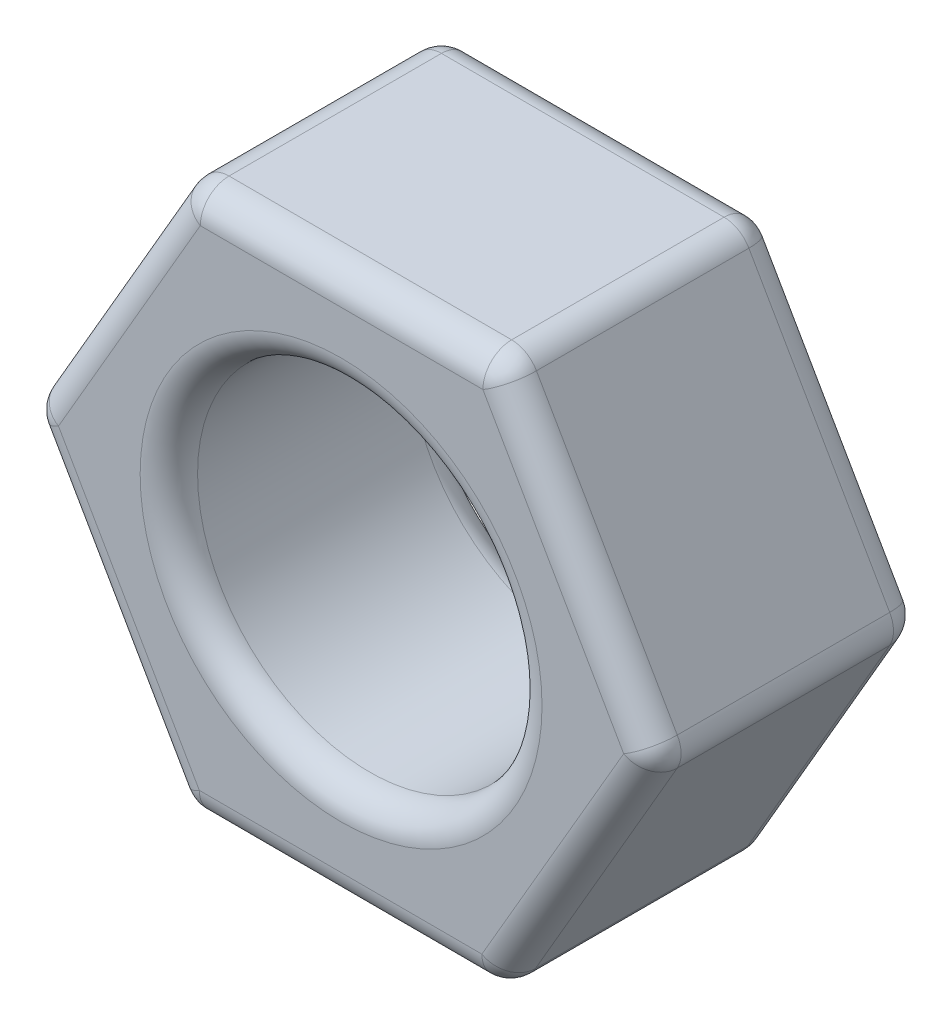
ISO-10303-21;
HEADER;
FILE_DESCRIPTION(('STEP AP214'),'2;1');
FILE_NAME('part.step','',(''),(''),'','','');
FILE_SCHEMA(('AUTOMOTIVE_DESIGN { 1 0 10303 214 1 1 1 1 }'));
ENDSEC;
DATA;
#1=APPLICATION_CONTEXT('core data for automotive mechanical design processes');
#2=APPLICATION_PROTOCOL_DEFINITION('international standard','automotive_design',2000,#1);
#3=PRODUCT_CONTEXT('',#1,'mechanical');
#4=PRODUCT('Part','Part','',(#3));
#5=PRODUCT_RELATED_PRODUCT_CATEGORY('part','',(#4));
#6=PRODUCT_DEFINITION_FORMATION('','',#4);
#7=PRODUCT_DEFINITION_CONTEXT('part definition',#1,'design');
#8=PRODUCT_DEFINITION('design','',#6,#7);
#9=PRODUCT_DEFINITION_SHAPE('','',#8);
#10=(LENGTH_UNIT() NAMED_UNIT(*) SI_UNIT(.MILLI.,.METRE.));
#11=(NAMED_UNIT(*) PLANE_ANGLE_UNIT() SI_UNIT($,.RADIAN.));
#12=(NAMED_UNIT(*) SI_UNIT($,.STERADIAN.) SOLID_ANGLE_UNIT());
#13=UNCERTAINTY_MEASURE_WITH_UNIT(LENGTH_MEASURE(1.E-05),#10,'distance_accuracy_value','');
#14=(GEOMETRIC_REPRESENTATION_CONTEXT(3) GLOBAL_UNCERTAINTY_ASSIGNED_CONTEXT((#13)) GLOBAL_UNIT_ASSIGNED_CONTEXT((#10,
#11,#12)) REPRESENTATION_CONTEXT('',''));
#15=CARTESIAN_POINT('',(0.,0.,0.));
#16=DIRECTION('',(0.,0.,1.));
#17=DIRECTION('',(1.,0.,0.));
#18=AXIS2_PLACEMENT_3D('',#15,#16,#17);
#19=CARTESIAN_POINT('',(0.,0.,4.7));
#20=DIRECTION('',(0.,0.,1.));
#21=DIRECTION('',(1.,0.,0.));
#22=AXIS2_PLACEMENT_3D('',#19,#20,#21);
#23=PLANE('',#22);
#24=CARTESIAN_POINT('',(0.,0.,4.7));
#25=DIRECTION('',(0.,0.,1.));
#26=DIRECTION('',(1.,0.,0.));
#27=AXIS2_PLACEMENT_3D('',#24,#25,#26);
#28=CIRCLE('',#27,3.5);
#29=CARTESIAN_POINT('',(3.5,0.,4.7));
#30=VERTEX_POINT('',#29);
#31=EDGE_CURVE('E305',#30,#30,#28,.F.);
#32=ORIENTED_EDGE('',*,*,#31,.T.);
#33=EDGE_LOOP('',(#32));
#34=FACE_BOUND('',#33,.T.);
#35=DIRECTION('',(-0.498244647432944,0.867036487873735,0.));
#36=VECTOR('',#35,1.);
#37=CARTESIAN_POINT('',(2.32612491040935,4.50843688880732,4.7));
#38=LINE('',#37,#36);
#39=CARTESIAN_POINT('',(4.92263963063168,-0.00997191966265563,4.7));
#40=VERTEX_POINT('',#39);
#41=CARTESIAN_POINT('',(2.4699557510682,4.25814501397176,4.7));
#42=VERTEX_POINT('',#41);
#43=EDGE_CURVE('E295',#40,#42,#38,.T.);
#44=ORIENTED_EDGE('',*,*,#43,.T.);
#45=DIRECTION('',(-0.999997948223165,0.00202572196031843,0.));
#46=VECTOR('',#45,1.);
#47=CARTESIAN_POINT('',(-2.74135842186134,4.26870170919396,4.7));
#48=LINE('',#47,#46);
#49=CARTESIAN_POINT('',(-2.45268387956348,4.26811693363441,4.7));
#50=VERTEX_POINT('',#49);
#51=EDGE_CURVE('E298',#42,#50,#48,.T.);
#52=ORIENTED_EDGE('',*,*,#51,.T.);
#53=DIRECTION('',(-0.501753300790222,-0.865010765913417,0.));
#54=VECTOR('',#53,1.);
#55=CARTESIAN_POINT('',(-5.06748333227069,-0.239735179613362,4.7));
#56=LINE('',#55,#54);
#57=CARTESIAN_POINT('',(-4.92263963063168,0.00997191966265725,4.7));
#58=VERTEX_POINT('',#57);
#59=EDGE_CURVE('E296',#50,#58,#56,.T.);
#60=ORIENTED_EDGE('',*,*,#59,.T.);
#61=DIRECTION('',(0.498244647432943,-0.867036487873736,0.));
#62=VECTOR('',#61,1.);
#63=CARTESIAN_POINT('',(-2.32612491040935,-4.50843688880732,4.7));
#64=LINE('',#63,#62);
#65=CARTESIAN_POINT('',(-2.4699557510682,-4.25814501397176,4.7));
#66=VERTEX_POINT('',#65);
#67=EDGE_CURVE('E396',#58,#66,#64,.T.);
#68=ORIENTED_EDGE('',*,*,#67,.T.);
#69=DIRECTION('',(0.999997948223165,-0.00202572196031827,0.));
#70=VECTOR('',#69,1.);
#71=CARTESIAN_POINT('',(2.74135842186135,-4.26870170919396,4.7));
#72=LINE('',#71,#70);
#73=CARTESIAN_POINT('',(2.45268387956349,-4.26811693363441,4.7));
#74=VERTEX_POINT('',#73);
#75=EDGE_CURVE('E300',#66,#74,#72,.T.);
#76=ORIENTED_EDGE('',*,*,#75,.T.);
#77=DIRECTION('',(0.501753300790222,0.865010765913418,0.));
#78=VECTOR('',#77,1.);
#79=CARTESIAN_POINT('',(5.06748333227069,0.239735179613363,4.7));
#80=LINE('',#79,#78);
#81=EDGE_CURVE('E291',#74,#40,#80,.T.);
#82=ORIENTED_EDGE('',*,*,#81,.T.);
#83=EDGE_LOOP('',(#44,#52,#60,#68,#76,#82));
#84=FACE_BOUND('',#83,.T.);
#85=ADVANCED_FACE('F35',(#34,#84),#23,.T.);
#86=CARTESIAN_POINT('',(0.,0.,0.));
#87=DIRECTION('',(0.,0.,1.));
#88=DIRECTION('',(1.,0.,0.));
#89=AXIS2_PLACEMENT_3D('',#86,#87,#88);
#90=PLANE('',#89);
#91=CARTESIAN_POINT('',(0.,0.,0.));
#92=DIRECTION('',(0.,0.,1.));
#93=DIRECTION('',(1.,0.,0.));
#94=AXIS2_PLACEMENT_3D('',#91,#92,#93);
#95=CIRCLE('',#94,3.5);
#96=CARTESIAN_POINT('',(3.5,0.,0.));
#97=VERTEX_POINT('',#96);
#98=EDGE_CURVE('E387',#97,#97,#95,.T.);
#99=ORIENTED_EDGE('',*,*,#98,.T.);
#100=EDGE_LOOP('',(#99));
#101=FACE_BOUND('',#100,.T.);
#102=DIRECTION('',(-0.999997948223165,0.00202572196031843,0.));
#103=VECTOR('',#102,1.);
#104=CARTESIAN_POINT('',(0.00863593575235954,4.26313097380308,0.));
#105=LINE('',#104,#103);
#106=CARTESIAN_POINT('',(-2.45268387956348,4.26811693363441,0.));
#107=VERTEX_POINT('',#106);
#108=CARTESIAN_POINT('',(2.4699557510682,4.25814501397175,0.));
#109=VERTEX_POINT('',#108);
#110=EDGE_CURVE('E383',#107,#109,#105,.F.);
#111=ORIENTED_EDGE('',*,*,#110,.T.);
#112=DIRECTION('',(-0.498244647432944,0.867036487873735,0.));
#113=VECTOR('',#112,1.);
#114=CARTESIAN_POINT('',(3.69629769084994,2.12408654715455,0.));
#115=LINE('',#114,#113);
#116=CARTESIAN_POINT('',(4.92263963063169,-0.0099719196626546,0.));
#117=VERTEX_POINT('',#116);
#118=EDGE_CURVE('E385',#109,#117,#115,.F.);
#119=ORIENTED_EDGE('',*,*,#118,.T.);
#120=DIRECTION('',(0.501753300790222,0.865010765913418,0.));
#121=VECTOR('',#120,1.);
#122=CARTESIAN_POINT('',(3.68766175509759,-2.13904442664853,0.));
#123=LINE('',#122,#121);
#124=CARTESIAN_POINT('',(2.45268387956349,-4.26811693363441,0.));
#125=VERTEX_POINT('',#124);
#126=EDGE_CURVE('E380',#117,#125,#123,.F.);
#127=ORIENTED_EDGE('',*,*,#126,.T.);
#128=DIRECTION('',(0.999997948223165,-0.00202572196031827,0.));
#129=VECTOR('',#128,1.);
#130=CARTESIAN_POINT('',(-0.00863593575235885,-4.26313097380308,0.));
#131=LINE('',#130,#129);
#132=CARTESIAN_POINT('',(-2.4699557510682,-4.25814501397176,0.));
#133=VERTEX_POINT('',#132);
#134=EDGE_CURVE('E378',#125,#133,#131,.F.);
#135=ORIENTED_EDGE('',*,*,#134,.T.);
#136=DIRECTION('',(0.498244647432943,-0.867036487873736,0.));
#137=VECTOR('',#136,1.);
#138=CARTESIAN_POINT('',(-3.69629769084994,-2.12408654715455,0.));
#139=LINE('',#138,#137);
#140=CARTESIAN_POINT('',(-4.92263963063168,0.0099719196626558,0.));
#141=VERTEX_POINT('',#140);
#142=EDGE_CURVE('E376',#133,#141,#139,.F.);
#143=ORIENTED_EDGE('',*,*,#142,.T.);
#144=DIRECTION('',(-0.501753300790222,-0.865010765913417,0.));
#145=VECTOR('',#144,1.);
#146=CARTESIAN_POINT('',(-3.68766175509758,2.13904442664854,0.));
#147=LINE('',#146,#145);
#148=EDGE_CURVE('E192',#141,#107,#147,.F.);
#149=ORIENTED_EDGE('',*,*,#148,.T.);
#150=EDGE_LOOP('',(#111,#119,#127,#135,#143,#149));
#151=FACE_BOUND('',#150,.T.);
#152=ADVANCED_FACE('F453',(#101,#151),#90,.F.);
#153=CARTESIAN_POINT('',(2.75964315434622,4.75755921252379,4.7));
#154=DIRECTION('',(-0.00202572196031843,-0.999997948223165,0.));
#155=DIRECTION('',(0.999997948223165,-0.00202572196031843,0.));
#156=AXIS2_PLACEMENT_3D('',#153,#154,#155);
#157=PLANE('',#156);
#158=DIRECTION('',(0.,0.,-1.));
#159=VECTOR('',#158,1.);
#160=CARTESIAN_POINT('',(2.47096861204836,4.75814398808334,4.7));
#161=LINE('',#160,#159);
#162=CARTESIAN_POINT('',(2.47096861204836,4.75814398808334,4.2));
#163=VERTEX_POINT('',#162);
#164=CARTESIAN_POINT('',(2.47096861204836,4.75814398808334,0.5));
#165=VERTEX_POINT('',#164);
#166=EDGE_CURVE('E346',#163,#165,#161,.T.);
#167=ORIENTED_EDGE('',*,*,#166,.T.);
#168=DIRECTION('',(-0.999997948223165,0.00202572196031843,0.));
#169=VECTOR('',#168,1.);
#170=CARTESIAN_POINT('',(2.75964315434622,4.75755921252379,0.5));
#171=LINE('',#170,#169);
#172=CARTESIAN_POINT('',(-2.45167101858332,4.76811590774599,0.5));
#173=VERTEX_POINT('',#172);
#174=EDGE_CURVE('E352',#165,#173,#171,.T.);
#175=ORIENTED_EDGE('',*,*,#174,.T.);
#176=DIRECTION('',(0.,0.,-1.));
#177=VECTOR('',#176,1.);
#178=CARTESIAN_POINT('',(-2.45167101858332,4.76811590774599,4.7));
#179=LINE('',#178,#177);
#180=CARTESIAN_POINT('',(-2.45167101858332,4.76811590774599,4.2));
#181=VERTEX_POINT('',#180);
#182=EDGE_CURVE('E349',#173,#181,#179,.F.);
#183=ORIENTED_EDGE('',*,*,#182,.T.);
#184=DIRECTION('',(-0.999997948223165,0.00202572196031843,0.));
#185=VECTOR('',#184,1.);
#186=CARTESIAN_POINT('',(2.75964315434622,4.75755921252379,4.2));
#187=LINE('',#186,#185);
#188=EDGE_CURVE('E340',#181,#163,#187,.F.);
#189=ORIENTED_EDGE('',*,*,#188,.T.);
#190=EDGE_LOOP('',(#167,#175,#183,#189));
#191=FACE_BOUND('',#190,.T.);
#192=ADVANCED_FACE('F350',(#191),#157,.F.);
#193=CARTESIAN_POINT('',(-2.74034556088118,4.76870068330554,4.7));
#194=DIRECTION('',(0.865010765913417,-0.501753300790222,0.));
#195=DIRECTION('',(0.501753300790222,0.865010765913417,0.));
#196=AXIS2_PLACEMENT_3D('',#193,#194,#195);
#197=PLANE('',#196);
#198=DIRECTION('',(-0.501753300790222,-0.865010765913417,0.));
#199=VECTOR('',#198,1.);
#200=CARTESIAN_POINT('',(-2.74034556088118,4.76870068330554,4.2));
#201=LINE('',#200,#199);
#202=CARTESIAN_POINT('',(-5.35514501358839,0.260848570057767,4.2));
#203=VERTEX_POINT('',#202);
#204=CARTESIAN_POINT('',(-2.88518926252019,4.51899358402952,4.2));
#205=VERTEX_POINT('',#204);
#206=EDGE_CURVE('E170',#203,#205,#201,.F.);
#207=ORIENTED_EDGE('',*,*,#206,.T.);
#208=DIRECTION('',(0.,0.,-1.));
#209=VECTOR('',#208,1.);
#210=CARTESIAN_POINT('',(-2.88518926252019,4.51899358402952,4.7));
#211=LINE('',#210,#209);
#212=CARTESIAN_POINT('',(-2.88518926252019,4.51899358402952,0.5));
#213=VERTEX_POINT('',#212);
#214=EDGE_CURVE('E166',#205,#213,#211,.T.);
#215=ORIENTED_EDGE('',*,*,#214,.T.);
#216=DIRECTION('',(-0.501753300790222,-0.865010765913417,0.));
#217=VECTOR('',#216,1.);
#218=CARTESIAN_POINT('',(-2.74034556088118,4.76870068330554,0.5));
#219=LINE('',#218,#217);
#220=CARTESIAN_POINT('',(-5.35514501358839,0.260848570057767,0.5));
#221=VERTEX_POINT('',#220);
#222=EDGE_CURVE('E160',#213,#221,#219,.T.);
#223=ORIENTED_EDGE('',*,*,#222,.T.);
#224=DIRECTION('',(0.,0.,-1.));
#225=VECTOR('',#224,1.);
#226=CARTESIAN_POINT('',(-5.35514501358839,0.260848570057767,4.7));
#227=LINE('',#226,#225);
#228=EDGE_CURVE('E163',#221,#203,#227,.F.);
#229=ORIENTED_EDGE('',*,*,#228,.T.);
#230=EDGE_LOOP('',(#207,#215,#223,#229));
#231=FACE_BOUND('',#230,.T.);
#232=ADVANCED_FACE('F162',(#231),#197,.F.);
#233=CARTESIAN_POINT('',(-5.4999887152274,0.0111414707817489,4.7));
#234=DIRECTION('',(0.867036487873736,0.498244647432943,0.));
#235=DIRECTION('',(-0.498244647432943,0.867036487873736,0.));
#236=AXIS2_PLACEMENT_3D('',#233,#234,#235);
#237=PLANE('',#236);
#238=DIRECTION('',(0.498244647432943,-0.867036487873736,0.));
#239=VECTOR('',#238,1.);
#240=CARTESIAN_POINT('',(-5.4999887152274,0.0111414707817488,4.2));
#241=LINE('',#240,#239);
#242=CARTESIAN_POINT('',(-2.90347399500507,-4.50726733768823,4.2));
#243=VERTEX_POINT('',#242);
#244=CARTESIAN_POINT('',(-5.35615787456855,-0.239150404053816,4.2));
#245=VERTEX_POINT('',#244);
#246=EDGE_CURVE('E44',#243,#245,#241,.F.);
#247=ORIENTED_EDGE('',*,*,#246,.T.);
#248=DIRECTION('',(0.,0.,-1.));
#249=VECTOR('',#248,1.);
#250=CARTESIAN_POINT('',(-5.35615787456855,-0.239150404053816,4.7));
#251=LINE('',#250,#249);
#252=CARTESIAN_POINT('',(-5.35615787456855,-0.239150404053816,0.5));
#253=VERTEX_POINT('',#252);
#254=EDGE_CURVE('E11',#245,#253,#251,.T.);
#255=ORIENTED_EDGE('',*,*,#254,.T.);
#256=DIRECTION('',(0.498244647432943,-0.867036487873736,0.));
#257=VECTOR('',#256,1.);
#258=CARTESIAN_POINT('',(-5.4999887152274,0.0111414707817489,0.5));
#259=LINE('',#258,#257);
#260=CARTESIAN_POINT('',(-2.90347399500507,-4.50726733768823,0.5));
#261=VERTEX_POINT('',#260);
#262=EDGE_CURVE('E317',#253,#261,#259,.T.);
#263=ORIENTED_EDGE('',*,*,#262,.T.);
#264=DIRECTION('',(0.,0.,-1.));
#265=VECTOR('',#264,1.);
#266=CARTESIAN_POINT('',(-2.90347399500507,-4.50726733768823,4.7));
#267=LINE('',#266,#265);
#268=EDGE_CURVE('E55',#261,#243,#267,.F.);
#269=ORIENTED_EDGE('',*,*,#268,.T.);
#270=EDGE_LOOP('',(#247,#255,#263,#269));
#271=FACE_BOUND('',#270,.T.);
#272=ADVANCED_FACE('F495',(#271),#237,.F.);
#273=CARTESIAN_POINT('',(-2.75964315434622,-4.75755921252379,4.7));
#274=DIRECTION('',(0.00202572196031827,0.999997948223165,0.));
#275=DIRECTION('',(-0.999997948223165,0.00202572196031827,0.));
#276=AXIS2_PLACEMENT_3D('',#273,#274,#275);
#277=PLANE('',#276);
#278=DIRECTION('',(0.,0.,-1.));
#279=VECTOR('',#278,1.);
#280=CARTESIAN_POINT('',(2.45167101858333,-4.768115907746,4.7));
#281=LINE('',#280,#279);
#282=CARTESIAN_POINT('',(2.45167101858333,-4.768115907746,0.5));
#283=VERTEX_POINT('',#282);
#284=CARTESIAN_POINT('',(2.45167101858333,-4.768115907746,4.2));
#285=VERTEX_POINT('',#284);
#286=EDGE_CURVE('E312',#283,#285,#281,.F.);
#287=ORIENTED_EDGE('',*,*,#286,.T.);
#288=DIRECTION('',(0.999997948223165,-0.00202572196031827,0.));
#289=VECTOR('',#288,1.);
#290=CARTESIAN_POINT('',(-2.75964315434622,-4.75755921252379,4.2));
#291=LINE('',#290,#289);
#292=CARTESIAN_POINT('',(-2.47096861204836,-4.75814398808334,4.2));
#293=VERTEX_POINT('',#292);
#294=EDGE_CURVE('E314',#285,#293,#291,.F.);
#295=ORIENTED_EDGE('',*,*,#294,.T.);
#296=DIRECTION('',(0.,0.,-1.));
#297=VECTOR('',#296,1.);
#298=CARTESIAN_POINT('',(-2.47096861204836,-4.75814398808334,4.7));
#299=LINE('',#298,#297);
#300=CARTESIAN_POINT('',(-2.47096861204836,-4.75814398808334,0.5));
#301=VERTEX_POINT('',#300);
#302=EDGE_CURVE('E308',#293,#301,#299,.T.);
#303=ORIENTED_EDGE('',*,*,#302,.T.);
#304=DIRECTION('',(0.999997948223165,-0.00202572196031827,0.));
#305=VECTOR('',#304,1.);
#306=CARTESIAN_POINT('',(-2.75964315434622,-4.75755921252379,0.5));
#307=LINE('',#306,#305);
#308=EDGE_CURVE('E310',#301,#283,#307,.T.);
#309=ORIENTED_EDGE('',*,*,#308,.T.);
#310=EDGE_LOOP('',(#287,#295,#303,#309));
#311=FACE_BOUND('',#310,.T.);
#312=ADVANCED_FACE('F404',(#311),#277,.F.);
#313=CARTESIAN_POINT('',(2.74034556088119,-4.76870068330554,4.7));
#314=DIRECTION('',(-0.865010765913418,0.501753300790222,0.));
#315=DIRECTION('',(-0.501753300790222,-0.865010765913418,0.));
#316=AXIS2_PLACEMENT_3D('',#313,#314,#315);
#317=PLANE('',#316);
#318=DIRECTION('',(0.501753300790222,0.865010765913418,0.));
#319=VECTOR('',#318,1.);
#320=CARTESIAN_POINT('',(2.74034556088119,-4.76870068330554,0.5));
#321=LINE('',#320,#319);
#322=CARTESIAN_POINT('',(2.8851892625202,-4.51899358402952,0.5));
#323=VERTEX_POINT('',#322);
#324=CARTESIAN_POINT('',(5.35514501358839,-0.260848570057766,0.5));
#325=VERTEX_POINT('',#324);
#326=EDGE_CURVE('E372',#323,#325,#321,.T.);
#327=ORIENTED_EDGE('',*,*,#326,.T.);
#328=DIRECTION('',(0.,0.,-1.));
#329=VECTOR('',#328,1.);
#330=CARTESIAN_POINT('',(5.35514501358839,-0.260848570057766,4.7));
#331=LINE('',#330,#329);
#332=CARTESIAN_POINT('',(5.35514501358839,-0.260848570057766,4.2));
#333=VERTEX_POINT('',#332);
#334=EDGE_CURVE('E374',#325,#333,#331,.F.);
#335=ORIENTED_EDGE('',*,*,#334,.T.);
#336=DIRECTION('',(0.501753300790222,0.865010765913418,0.));
#337=VECTOR('',#336,1.);
#338=CARTESIAN_POINT('',(2.74034556088119,-4.76870068330554,4.2));
#339=LINE('',#338,#337);
#340=CARTESIAN_POINT('',(2.8851892625202,-4.51899358402952,4.2));
#341=VERTEX_POINT('',#340);
#342=EDGE_CURVE('E289',#333,#341,#339,.F.);
#343=ORIENTED_EDGE('',*,*,#342,.T.);
#344=DIRECTION('',(0.,0.,-1.));
#345=VECTOR('',#344,1.);
#346=CARTESIAN_POINT('',(2.8851892625202,-4.51899358402952,4.7));
#347=LINE('',#346,#345);
#348=EDGE_CURVE('E369',#341,#323,#347,.T.);
#349=ORIENTED_EDGE('',*,*,#348,.T.);
#350=EDGE_LOOP('',(#327,#335,#343,#349));
#351=FACE_BOUND('',#350,.T.);
#352=ADVANCED_FACE('F416',(#351),#317,.F.);
#353=CARTESIAN_POINT('',(5.4999887152274,-0.0111414707817478,4.7));
#354=DIRECTION('',(-0.867036487873735,-0.498244647432943,0.));
#355=DIRECTION('',(0.498244647432944,-0.867036487873735,0.));
#356=AXIS2_PLACEMENT_3D('',#353,#354,#355);
#357=PLANE('',#356);
#358=DIRECTION('',(0.,0.,-1.));
#359=VECTOR('',#358,1.);
#360=CARTESIAN_POINT('',(5.35615787456855,0.239150404053816,4.7));
#361=LINE('',#360,#359);
#362=CARTESIAN_POINT('',(5.35615787456855,0.239150404053816,4.2));
#363=VERTEX_POINT('',#362);
#364=CARTESIAN_POINT('',(5.35615787456855,0.239150404053816,0.5));
#365=VERTEX_POINT('',#364);
#366=EDGE_CURVE('E364',#363,#365,#361,.T.);
#367=ORIENTED_EDGE('',*,*,#366,.T.);
#368=DIRECTION('',(-0.498244647432944,0.867036487873735,0.));
#369=VECTOR('',#368,1.);
#370=CARTESIAN_POINT('',(5.4999887152274,-0.0111414707817478,0.5));
#371=LINE('',#370,#369);
#372=CARTESIAN_POINT('',(2.90347399500507,4.50726733768823,0.5));
#373=VERTEX_POINT('',#372);
#374=EDGE_CURVE('E367',#365,#373,#371,.T.);
#375=ORIENTED_EDGE('',*,*,#374,.T.);
#376=DIRECTION('',(0.,0.,-1.));
#377=VECTOR('',#376,1.);
#378=CARTESIAN_POINT('',(2.90347399500507,4.50726733768823,4.7));
#379=LINE('',#378,#377);
#380=CARTESIAN_POINT('',(2.90347399500507,4.50726733768823,4.2));
#381=VERTEX_POINT('',#380);
#382=EDGE_CURVE('E362',#373,#381,#379,.F.);
#383=ORIENTED_EDGE('',*,*,#382,.T.);
#384=DIRECTION('',(-0.498244647432944,0.867036487873735,0.));
#385=VECTOR('',#384,1.);
#386=CARTESIAN_POINT('',(5.4999887152274,-0.0111414707817484,4.2));
#387=LINE('',#386,#385);
#388=EDGE_CURVE('E357',#381,#363,#387,.F.);
#389=ORIENTED_EDGE('',*,*,#388,.T.);
#390=EDGE_LOOP('',(#367,#375,#383,#389));
#391=FACE_BOUND('',#390,.T.);
#392=ADVANCED_FACE('F463',(#391),#357,.F.);
#393=CARTESIAN_POINT('',(0.,0.,4.7));
#394=DIRECTION('',(0.,0.,-1.));
#395=DIRECTION('',(-1.,0.,0.));
#396=AXIS2_PLACEMENT_3D('',#393,#394,#395);
#397=CYLINDRICAL_SURFACE('',#396,3.);
#398=CARTESIAN_POINT('',(0.,0.,0.5));
#399=DIRECTION('',(0.,0.,1.));
#400=DIRECTION('',(1.,0.,0.));
#401=AXIS2_PLACEMENT_3D('',#398,#399,#400);
#402=CIRCLE('',#401,3.);
#403=CARTESIAN_POINT('',(3.,0.,0.5));
#404=VERTEX_POINT('',#403);
#405=EDGE_CURVE('E393',#404,#404,#402,.F.);
#406=ORIENTED_EDGE('',*,*,#405,.T.);
#407=EDGE_LOOP('',(#406));
#408=FACE_BOUND('',#407,.T.);
#409=CARTESIAN_POINT('',(0.,0.,4.2));
#410=DIRECTION('',(0.,0.,1.));
#411=DIRECTION('',(1.,0.,0.));
#412=AXIS2_PLACEMENT_3D('',#409,#410,#411);
#413=CIRCLE('',#412,3.);
#414=CARTESIAN_POINT('',(3.,0.,4.2));
#415=VERTEX_POINT('',#414);
#416=EDGE_CURVE('E390',#415,#415,#413,.T.);
#417=ORIENTED_EDGE('',*,*,#416,.T.);
#418=EDGE_LOOP('',(#417));
#419=FACE_BOUND('',#418,.T.);
#420=ADVANCED_FACE('F487',(#408,#419),#397,.F.);
#421=CARTESIAN_POINT('',(2.45268387956349,-4.26811693363441,4.7));
#422=DIRECTION('',(0.,0.,-1.));
#423=DIRECTION('',(-1.,0.,0.));
#424=AXIS2_PLACEMENT_3D('',#421,#422,#423);
#425=CYLINDRICAL_SURFACE('',#424,0.5);
#426=CARTESIAN_POINT('',(2.45268387956349,-4.26811693363441,4.2));
#427=DIRECTION('',(0.,0.,1.));
#428=DIRECTION('',(1.,0.,0.));
#429=AXIS2_PLACEMENT_3D('',#426,#427,#428);
#430=CIRCLE('',#429,0.5);
#431=EDGE_CURVE('E39',#285,#341,#430,.T.);
#432=ORIENTED_EDGE('',*,*,#431,.F.);
#433=ORIENTED_EDGE('',*,*,#286,.F.);
#434=CARTESIAN_POINT('',(2.45268387956349,-4.26811693363441,0.5));
#435=DIRECTION('',(0.,0.,-1.));
#436=DIRECTION('',(-1.,0.,0.));
#437=AXIS2_PLACEMENT_3D('',#434,#435,#436);
#438=CIRCLE('',#437,0.5);
#439=EDGE_CURVE('E268',#323,#283,#438,.T.);
#440=ORIENTED_EDGE('',*,*,#439,.F.);
#441=ORIENTED_EDGE('',*,*,#348,.F.);
#442=EDGE_LOOP('',(#432,#433,#440,#441));
#443=FACE_BOUND('',#442,.T.);
#444=ADVANCED_FACE('F406',(#443),#425,.T.);
#445=CARTESIAN_POINT('',(2.45268387956349,-4.26811693363441,4.2));
#446=DIRECTION('',(0.,0.,1.));
#447=DIRECTION('',(1.,0.,0.));
#448=AXIS2_PLACEMENT_3D('',#445,#446,#447);
#449=SPHERICAL_SURFACE('',#448,0.5);
#450=CARTESIAN_POINT('',(2.45268387956349,-4.26811693363441,4.2));
#451=DIRECTION('',(0.999997948223165,-0.00202572196031804,0.));
#452=DIRECTION('',(0.00202572196031804,0.999997948223165,0.));
#453=AXIS2_PLACEMENT_3D('',#450,#451,#452);
#454=CIRCLE('',#453,0.5);
#455=EDGE_CURVE('E263',#285,#74,#454,.F.);
#456=ORIENTED_EDGE('',*,*,#455,.F.);
#457=ORIENTED_EDGE('',*,*,#431,.T.);
#458=CARTESIAN_POINT('',(2.45268387956349,-4.26811693363441,4.2));
#459=DIRECTION('',(-0.501753300790221,-0.865010765913418,0.));
#460=DIRECTION('',(0.865010765913418,-0.501753300790221,0.));
#461=AXIS2_PLACEMENT_3D('',#458,#459,#460);
#462=CIRCLE('',#461,0.5);
#463=EDGE_CURVE('E266',#74,#341,#462,.F.);
#464=ORIENTED_EDGE('',*,*,#463,.F.);
#465=EDGE_LOOP('',(#456,#457,#464));
#466=FACE_BOUND('',#465,.T.);
#467=ADVANCED_FACE('F279',(#466),#449,.T.);
#468=CARTESIAN_POINT('',(2.45268387956349,-4.26811693363441,0.5));
#469=DIRECTION('',(0.,0.,1.));
#470=DIRECTION('',(1.,0.,0.));
#471=AXIS2_PLACEMENT_3D('',#468,#469,#470);
#472=SPHERICAL_SURFACE('',#471,0.5);
#473=CARTESIAN_POINT('',(2.45268387956349,-4.26811693363441,0.5));
#474=DIRECTION('',(-0.501753300790221,-0.865010765913418,0.));
#475=DIRECTION('',(0.865010765913418,-0.501753300790221,0.));
#476=AXIS2_PLACEMENT_3D('',#473,#474,#475);
#477=CIRCLE('',#476,0.5);
#478=EDGE_CURVE('E257',#323,#125,#477,.F.);
#479=ORIENTED_EDGE('',*,*,#478,.F.);
#480=ORIENTED_EDGE('',*,*,#439,.T.);
#481=CARTESIAN_POINT('',(2.45268387956349,-4.26811693363441,0.5));
#482=DIRECTION('',(0.999997948223165,-0.00202572196031803,0.));
#483=DIRECTION('',(0.00202572196031803,0.999997948223165,0.));
#484=AXIS2_PLACEMENT_3D('',#481,#482,#483);
#485=CIRCLE('',#484,0.5);
#486=EDGE_CURVE('E260',#125,#283,#485,.F.);
#487=ORIENTED_EDGE('',*,*,#486,.F.);
#488=EDGE_LOOP('',(#479,#480,#487));
#489=FACE_BOUND('',#488,.T.);
#490=ADVANCED_FACE('F408',(#489),#472,.T.);
#491=CARTESIAN_POINT('',(3.68766175509759,-2.13904442664853,4.2));
#492=DIRECTION('',(-0.501753300790222,-0.865010765913418,0.));
#493=DIRECTION('',(0.865010765913418,-0.501753300790222,0.));
#494=AXIS2_PLACEMENT_3D('',#491,#492,#493);
#495=CYLINDRICAL_SURFACE('',#494,0.5);
#496=ORIENTED_EDGE('',*,*,#463,.T.);
#497=ORIENTED_EDGE('',*,*,#342,.F.);
#498=CARTESIAN_POINT('',(4.92263963063168,-0.00997191966265563,4.2));
#499=DIRECTION('',(0.50175330079022,0.865010765913419,0.));
#500=DIRECTION('',(-0.865010765913419,0.50175330079022,0.));
#501=AXIS2_PLACEMENT_3D('',#498,#499,#500);
#502=CIRCLE('',#501,0.5);
#503=EDGE_CURVE('E252',#40,#333,#502,.T.);
#504=ORIENTED_EDGE('',*,*,#503,.F.);
#505=ORIENTED_EDGE('',*,*,#81,.F.);
#506=EDGE_LOOP('',(#496,#497,#504,#505));
#507=FACE_BOUND('',#506,.T.);
#508=ADVANCED_FACE('F287',(#507),#495,.T.);
#509=CARTESIAN_POINT('',(-0.00863593575235885,-4.26313097380308,4.2));
#510=DIRECTION('',(-0.999997948223165,0.00202572196031827,0.));
#511=DIRECTION('',(-0.00202572196031827,-0.999997948223165,0.));
#512=AXIS2_PLACEMENT_3D('',#509,#510,#511);
#513=CYLINDRICAL_SURFACE('',#512,0.5);
#514=ORIENTED_EDGE('',*,*,#455,.T.);
#515=ORIENTED_EDGE('',*,*,#75,.F.);
#516=CARTESIAN_POINT('',(-2.4699557510682,-4.25814501397176,4.2));
#517=DIRECTION('',(-0.999997948223165,0.00202572196031803,0.));
#518=DIRECTION('',(-0.00202572196031803,-0.999997948223165,0.));
#519=AXIS2_PLACEMENT_3D('',#516,#517,#518);
#520=CIRCLE('',#519,0.5);
#521=EDGE_CURVE('E249',#293,#66,#520,.T.);
#522=ORIENTED_EDGE('',*,*,#521,.F.);
#523=ORIENTED_EDGE('',*,*,#294,.F.);
#524=EDGE_LOOP('',(#514,#515,#522,#523));
#525=FACE_BOUND('',#524,.T.);
#526=ADVANCED_FACE('F401',(#525),#513,.T.);
#527=CARTESIAN_POINT('',(-2.4699557510682,-4.25814501397176,4.7));
#528=DIRECTION('',(0.,0.,-1.));
#529=DIRECTION('',(-1.,0.,0.));
#530=AXIS2_PLACEMENT_3D('',#527,#528,#529);
#531=CYLINDRICAL_SURFACE('',#530,0.5);
#532=CARTESIAN_POINT('',(-2.4699557510682,-4.25814501397176,0.5));
#533=DIRECTION('',(0.,0.,-1.));
#534=DIRECTION('',(-1.,0.,0.));
#535=AXIS2_PLACEMENT_3D('',#532,#533,#534);
#536=CIRCLE('',#535,0.5);
#537=EDGE_CURVE('E244',#301,#261,#536,.T.);
#538=ORIENTED_EDGE('',*,*,#537,.F.);
#539=ORIENTED_EDGE('',*,*,#302,.F.);
#540=CARTESIAN_POINT('',(-2.4699557510682,-4.25814501397176,4.2));
#541=DIRECTION('',(0.,0.,1.));
#542=DIRECTION('',(1.,0.,0.));
#543=AXIS2_PLACEMENT_3D('',#540,#541,#542);
#544=CIRCLE('',#543,0.5);
#545=EDGE_CURVE('E247',#243,#293,#544,.T.);
#546=ORIENTED_EDGE('',*,*,#545,.F.);
#547=ORIENTED_EDGE('',*,*,#268,.F.);
#548=EDGE_LOOP('',(#538,#539,#546,#547));
#549=FACE_BOUND('',#548,.T.);
#550=ADVANCED_FACE('F444',(#549),#531,.T.);
#551=CARTESIAN_POINT('',(-2.75863029336606,-4.25756023841221,0.5));
#552=DIRECTION('',(0.999997948223165,-0.00202572196031827,0.));
#553=DIRECTION('',(0.00202572196031827,0.999997948223165,0.));
#554=AXIS2_PLACEMENT_3D('',#551,#552,#553);
#555=CYLINDRICAL_SURFACE('',#554,0.5);
#556=ORIENTED_EDGE('',*,*,#486,.T.);
#557=ORIENTED_EDGE('',*,*,#308,.F.);
#558=CARTESIAN_POINT('',(-2.4699557510682,-4.25814501397176,0.5));
#559=DIRECTION('',(-0.999997948223165,0.00202572196031803,0.));
#560=DIRECTION('',(-0.00202572196031803,-0.999997948223165,0.));
#561=AXIS2_PLACEMENT_3D('',#558,#559,#560);
#562=CIRCLE('',#561,0.5);
#563=EDGE_CURVE('E241',#133,#301,#562,.T.);
#564=ORIENTED_EDGE('',*,*,#563,.F.);
#565=ORIENTED_EDGE('',*,*,#134,.F.);
#566=EDGE_LOOP('',(#556,#557,#564,#565));
#567=FACE_BOUND('',#566,.T.);
#568=ADVANCED_FACE('F451',(#567),#555,.T.);
#569=CARTESIAN_POINT('',(2.30784017792448,-4.51782403291043,0.5));
#570=DIRECTION('',(0.501753300790222,0.865010765913418,0.));
#571=DIRECTION('',(-0.865010765913418,0.501753300790222,0.));
#572=AXIS2_PLACEMENT_3D('',#569,#570,#571);
#573=CYLINDRICAL_SURFACE('',#572,0.5);
#574=ORIENTED_EDGE('',*,*,#478,.T.);
#575=ORIENTED_EDGE('',*,*,#126,.F.);
#576=CARTESIAN_POINT('',(4.92263963063169,-0.00997191966265484,0.5));
#577=DIRECTION('',(0.501753300790222,0.865010765913418,0.));
#578=DIRECTION('',(-0.865010765913418,0.501753300790222,0.));
#579=AXIS2_PLACEMENT_3D('',#576,#577,#578);
#580=CIRCLE('',#579,0.5);
#581=EDGE_CURVE('E238',#325,#117,#580,.T.);
#582=ORIENTED_EDGE('',*,*,#581,.F.);
#583=ORIENTED_EDGE('',*,*,#326,.F.);
#584=EDGE_LOOP('',(#574,#575,#582,#583));
#585=FACE_BOUND('',#584,.T.);
#586=ADVANCED_FACE('F413',(#585),#573,.T.);
#587=CARTESIAN_POINT('',(4.92263963063169,-0.00997191966265501,4.7));
#588=DIRECTION('',(0.,0.,-1.));
#589=DIRECTION('',(-1.,0.,0.));
#590=AXIS2_PLACEMENT_3D('',#587,#588,#589);
#591=CYLINDRICAL_SURFACE('',#590,0.5);
#592=CARTESIAN_POINT('',(4.92263963063169,-0.00997191966265484,4.2));
#593=DIRECTION('',(0.,0.,1.));
#594=DIRECTION('',(1.,0.,0.));
#595=AXIS2_PLACEMENT_3D('',#592,#593,#594);
#596=CIRCLE('',#595,0.5);
#597=EDGE_CURVE('E254',#333,#363,#596,.T.);
#598=ORIENTED_EDGE('',*,*,#597,.F.);
#599=ORIENTED_EDGE('',*,*,#334,.F.);
#600=CARTESIAN_POINT('',(4.92263963063168,-0.00997191966265528,0.5));
#601=DIRECTION('',(0.,0.,-1.));
#602=DIRECTION('',(-1.,0.,0.));
#603=AXIS2_PLACEMENT_3D('',#600,#601,#602);
#604=CIRCLE('',#603,0.5);
#605=EDGE_CURVE('E235',#365,#325,#604,.T.);
#606=ORIENTED_EDGE('',*,*,#605,.F.);
#607=ORIENTED_EDGE('',*,*,#366,.F.);
#608=EDGE_LOOP('',(#598,#599,#606,#607));
#609=FACE_BOUND('',#608,.T.);
#610=ADVANCED_FACE('F420',(#609),#591,.T.);
#611=CARTESIAN_POINT('',(4.92263963063169,-0.00997191966265498,4.2));
#612=DIRECTION('',(0.,0.,1.));
#613=DIRECTION('',(1.,0.,0.));
#614=AXIS2_PLACEMENT_3D('',#611,#612,#613);
#615=SPHERICAL_SURFACE('',#614,0.5);
#616=ORIENTED_EDGE('',*,*,#503,.T.);
#617=ORIENTED_EDGE('',*,*,#597,.T.);
#618=CARTESIAN_POINT('',(4.92263963063168,-0.00997191966265528,4.2));
#619=DIRECTION('',(0.498244647432943,-0.867036487873735,0.));
#620=DIRECTION('',(0.867036487873735,0.498244647432943,0.));
#621=AXIS2_PLACEMENT_3D('',#618,#619,#620);
#622=CIRCLE('',#621,0.5);
#623=EDGE_CURVE('E232',#40,#363,#622,.F.);
#624=ORIENTED_EDGE('',*,*,#623,.F.);
#625=EDGE_LOOP('',(#616,#617,#624));
#626=FACE_BOUND('',#625,.T.);
#627=ADVANCED_FACE('F423',(#626),#615,.T.);
#628=CARTESIAN_POINT('',(-2.4699557510682,-4.25814501397176,4.2));
#629=DIRECTION('',(0.,0.,1.));
#630=DIRECTION('',(1.,0.,0.));
#631=AXIS2_PLACEMENT_3D('',#628,#629,#630);
#632=SPHERICAL_SURFACE('',#631,0.5);
#633=ORIENTED_EDGE('',*,*,#545,.T.);
#634=ORIENTED_EDGE('',*,*,#521,.T.);
#635=CARTESIAN_POINT('',(-2.4699557510682,-4.25814501397176,4.2));
#636=DIRECTION('',(0.49824464743294,-0.867036487873737,0.));
#637=DIRECTION('',(0.867036487873737,0.49824464743294,0.));
#638=AXIS2_PLACEMENT_3D('',#635,#636,#637);
#639=CIRCLE('',#638,0.5);
#640=EDGE_CURVE('E229',#243,#66,#639,.F.);
#641=ORIENTED_EDGE('',*,*,#640,.F.);
#642=EDGE_LOOP('',(#633,#634,#641));
#643=FACE_BOUND('',#642,.T.);
#644=ADVANCED_FACE('F441',(#643),#632,.T.);
#645=CARTESIAN_POINT('',(-2.4699557510682,-4.25814501397176,0.5));
#646=DIRECTION('',(0.,0.,1.));
#647=DIRECTION('',(1.,0.,0.));
#648=AXIS2_PLACEMENT_3D('',#645,#646,#647);
#649=SPHERICAL_SURFACE('',#648,0.5);
#650=ORIENTED_EDGE('',*,*,#563,.T.);
#651=ORIENTED_EDGE('',*,*,#537,.T.);
#652=CARTESIAN_POINT('',(-2.4699557510682,-4.25814501397176,0.5));
#653=DIRECTION('',(0.498244647432943,-0.867036487873736,0.));
#654=DIRECTION('',(0.867036487873736,0.498244647432943,0.));
#655=AXIS2_PLACEMENT_3D('',#652,#653,#654);
#656=CIRCLE('',#655,0.5);
#657=EDGE_CURVE('E226',#133,#261,#656,.F.);
#658=ORIENTED_EDGE('',*,*,#657,.F.);
#659=EDGE_LOOP('',(#650,#651,#658));
#660=FACE_BOUND('',#659,.T.);
#661=ADVANCED_FACE('F448',(#660),#649,.T.);
#662=CARTESIAN_POINT('',(4.92263963063169,-0.00997191966265471,0.5));
#663=DIRECTION('',(0.,0.,1.));
#664=DIRECTION('',(1.,0.,0.));
#665=AXIS2_PLACEMENT_3D('',#662,#663,#664);
#666=SPHERICAL_SURFACE('',#665,0.5);
#667=ORIENTED_EDGE('',*,*,#605,.T.);
#668=ORIENTED_EDGE('',*,*,#581,.T.);
#669=CARTESIAN_POINT('',(4.92263963063169,-0.00997191966265475,0.5));
#670=DIRECTION('',(0.498244647432943,-0.867036487873735,0.));
#671=DIRECTION('',(0.867036487873735,0.498244647432943,0.));
#672=AXIS2_PLACEMENT_3D('',#669,#670,#671);
#673=CIRCLE('',#672,0.5);
#674=EDGE_CURVE('E223',#365,#117,#673,.F.);
#675=ORIENTED_EDGE('',*,*,#674,.F.);
#676=EDGE_LOOP('',(#667,#668,#675));
#677=FACE_BOUND('',#676,.T.);
#678=ADVANCED_FACE('F457',(#677),#666,.T.);
#679=CARTESIAN_POINT('',(3.69629769084994,2.12408654715455,4.2));
#680=DIRECTION('',(0.498244647432944,-0.867036487873735,0.));
#681=DIRECTION('',(0.867036487873735,0.498244647432944,0.));
#682=AXIS2_PLACEMENT_3D('',#679,#680,#681);
#683=CYLINDRICAL_SURFACE('',#682,0.5);
#684=ORIENTED_EDGE('',*,*,#623,.T.);
#685=ORIENTED_EDGE('',*,*,#388,.F.);
#686=CARTESIAN_POINT('',(2.4699557510682,4.25814501397176,4.2));
#687=DIRECTION('',(-0.498244647432941,0.867036487873737,0.));
#688=DIRECTION('',(-0.867036487873737,-0.498244647432941,0.));
#689=AXIS2_PLACEMENT_3D('',#686,#687,#688);
#690=CIRCLE('',#689,0.5);
#691=EDGE_CURVE('E217',#42,#381,#690,.T.);
#692=ORIENTED_EDGE('',*,*,#691,.F.);
#693=ORIENTED_EDGE('',*,*,#43,.F.);
#694=EDGE_LOOP('',(#684,#685,#692,#693));
#695=FACE_BOUND('',#694,.T.);
#696=ADVANCED_FACE('F427',(#695),#683,.T.);
#697=CARTESIAN_POINT('',(-3.69629769084994,-2.12408654715455,4.2));
#698=DIRECTION('',(-0.498244647432943,0.867036487873736,0.));
#699=DIRECTION('',(-0.867036487873736,-0.498244647432943,0.));
#700=AXIS2_PLACEMENT_3D('',#697,#698,#699);
#701=CYLINDRICAL_SURFACE('',#700,0.5);
#702=ORIENTED_EDGE('',*,*,#640,.T.);
#703=ORIENTED_EDGE('',*,*,#67,.F.);
#704=CARTESIAN_POINT('',(-4.92263963063168,0.00997191966265574,4.2));
#705=DIRECTION('',(-0.498244647432943,0.867036487873736,0.));
#706=DIRECTION('',(-0.867036487873736,-0.498244647432943,0.));
#707=AXIS2_PLACEMENT_3D('',#704,#705,#706);
#708=CIRCLE('',#707,0.5);
#709=EDGE_CURVE('E214',#245,#58,#708,.T.);
#710=ORIENTED_EDGE('',*,*,#709,.F.);
#711=ORIENTED_EDGE('',*,*,#246,.F.);
#712=EDGE_LOOP('',(#702,#703,#710,#711));
#713=FACE_BOUND('',#712,.T.);
#714=ADVANCED_FACE('F438',(#713),#701,.T.);
#715=CARTESIAN_POINT('',(-4.92263963063168,0.00997191966265582,4.7));
#716=DIRECTION('',(0.,0.,-1.));
#717=DIRECTION('',(-1.,0.,0.));
#718=AXIS2_PLACEMENT_3D('',#715,#716,#717);
#719=CYLINDRICAL_SURFACE('',#718,0.5);
#720=CARTESIAN_POINT('',(-4.92263963063168,0.00997191966265574,0.5));
#721=DIRECTION('',(0.,0.,-1.));
#722=DIRECTION('',(-1.,0.,0.));
#723=AXIS2_PLACEMENT_3D('',#720,#721,#722);
#724=CIRCLE('',#723,0.5);
#725=EDGE_CURVE('E176',#253,#221,#724,.T.);
#726=ORIENTED_EDGE('',*,*,#725,.F.);
#727=ORIENTED_EDGE('',*,*,#254,.F.);
#728=CARTESIAN_POINT('',(-4.92263963063168,0.00997191966265604,4.2));
#729=DIRECTION('',(0.,0.,1.));
#730=DIRECTION('',(1.,0.,0.));
#731=AXIS2_PLACEMENT_3D('',#728,#729,#730);
#732=CIRCLE('',#731,0.5);
#733=EDGE_CURVE('E179',#203,#245,#732,.T.);
#734=ORIENTED_EDGE('',*,*,#733,.F.);
#735=ORIENTED_EDGE('',*,*,#228,.F.);
#736=EDGE_LOOP('',(#726,#727,#734,#735));
#737=FACE_BOUND('',#736,.T.);
#738=ADVANCED_FACE('F175',(#737),#719,.T.);
#739=CARTESIAN_POINT('',(-5.06647047129053,0.26026379449822,0.5));
#740=DIRECTION('',(0.498244647432943,-0.867036487873736,0.));
#741=DIRECTION('',(0.867036487873736,0.498244647432943,0.));
#742=AXIS2_PLACEMENT_3D('',#739,#740,#741);
#743=CYLINDRICAL_SURFACE('',#742,0.5);
#744=ORIENTED_EDGE('',*,*,#657,.T.);
#745=ORIENTED_EDGE('',*,*,#262,.F.);
#746=CARTESIAN_POINT('',(-4.92263963063168,0.0099719196626558,0.5));
#747=DIRECTION('',(-0.498244647432943,0.867036487873736,0.));
#748=DIRECTION('',(-0.867036487873736,-0.498244647432943,0.));
#749=AXIS2_PLACEMENT_3D('',#746,#747,#748);
#750=CIRCLE('',#749,0.5);
#751=EDGE_CURVE('E188',#141,#253,#750,.T.);
#752=ORIENTED_EDGE('',*,*,#751,.F.);
#753=ORIENTED_EDGE('',*,*,#142,.F.);
#754=EDGE_LOOP('',(#744,#745,#752,#753));
#755=FACE_BOUND('',#754,.T.);
#756=ADVANCED_FACE('F618',(#755),#743,.T.);
#757=CARTESIAN_POINT('',(5.06647047129054,-0.26026379449822,0.5));
#758=DIRECTION('',(-0.498244647432944,0.867036487873735,0.));
#759=DIRECTION('',(-0.867036487873735,-0.498244647432944,0.));
#760=AXIS2_PLACEMENT_3D('',#757,#758,#759);
#761=CYLINDRICAL_SURFACE('',#760,0.5);
#762=ORIENTED_EDGE('',*,*,#674,.T.);
#763=ORIENTED_EDGE('',*,*,#118,.F.);
#764=CARTESIAN_POINT('',(2.4699557510682,4.25814501397175,0.5));
#765=DIRECTION('',(-0.498244647432944,0.867036487873735,0.));
#766=DIRECTION('',(-0.867036487873735,-0.498244647432944,0.));
#767=AXIS2_PLACEMENT_3D('',#764,#765,#766);
#768=CIRCLE('',#767,0.5);
#769=EDGE_CURVE('E209',#373,#109,#768,.T.);
#770=ORIENTED_EDGE('',*,*,#769,.F.);
#771=ORIENTED_EDGE('',*,*,#374,.F.);
#772=EDGE_LOOP('',(#762,#763,#770,#771));
#773=FACE_BOUND('',#772,.T.);
#774=ADVANCED_FACE('F459',(#773),#761,.T.);
#775=CARTESIAN_POINT('',(2.4699557510682,4.25814501397175,4.7));
#776=DIRECTION('',(0.,0.,-1.));
#777=DIRECTION('',(-1.,0.,0.));
#778=AXIS2_PLACEMENT_3D('',#775,#776,#777);
#779=CYLINDRICAL_SURFACE('',#778,0.5);
#780=CARTESIAN_POINT('',(2.4699557510682,4.25814501397175,4.2));
#781=DIRECTION('',(0.,0.,1.));
#782=DIRECTION('',(1.,0.,0.));
#783=AXIS2_PLACEMENT_3D('',#780,#781,#782);
#784=CIRCLE('',#783,0.5);
#785=EDGE_CURVE('E220',#381,#163,#784,.T.);
#786=ORIENTED_EDGE('',*,*,#785,.F.);
#787=ORIENTED_EDGE('',*,*,#382,.F.);
#788=CARTESIAN_POINT('',(2.4699557510682,4.25814501397175,0.5));
#789=DIRECTION('',(0.,0.,-1.));
#790=DIRECTION('',(-1.,0.,0.));
#791=AXIS2_PLACEMENT_3D('',#788,#789,#790);
#792=CIRCLE('',#791,0.5);
#793=EDGE_CURVE('E206',#165,#373,#792,.T.);
#794=ORIENTED_EDGE('',*,*,#793,.F.);
#795=ORIENTED_EDGE('',*,*,#166,.F.);
#796=EDGE_LOOP('',(#786,#787,#794,#795));
#797=FACE_BOUND('',#796,.T.);
#798=ADVANCED_FACE('F466',(#797),#779,.T.);
#799=CARTESIAN_POINT('',(2.4699557510682,4.25814501397175,4.2));
#800=DIRECTION('',(0.,0.,1.));
#801=DIRECTION('',(1.,0.,0.));
#802=AXIS2_PLACEMENT_3D('',#799,#800,#801);
#803=SPHERICAL_SURFACE('',#802,0.5);
#804=ORIENTED_EDGE('',*,*,#691,.T.);
#805=ORIENTED_EDGE('',*,*,#785,.T.);
#806=CARTESIAN_POINT('',(2.4699557510682,4.25814501397175,4.2));
#807=DIRECTION('',(0.999997948223165,-0.00202572196031803,0.));
#808=DIRECTION('',(0.00202572196031803,0.999997948223165,0.));
#809=AXIS2_PLACEMENT_3D('',#806,#807,#808);
#810=CIRCLE('',#809,0.5);
#811=EDGE_CURVE('E197',#42,#163,#810,.F.);
#812=ORIENTED_EDGE('',*,*,#811,.F.);
#813=EDGE_LOOP('',(#804,#805,#812));
#814=FACE_BOUND('',#813,.T.);
#815=ADVANCED_FACE('F469',(#814),#803,.T.);
#816=CARTESIAN_POINT('',(-4.92263963063168,0.00997191966265604,4.2));
#817=DIRECTION('',(0.,0.,1.));
#818=DIRECTION('',(1.,0.,0.));
#819=AXIS2_PLACEMENT_3D('',#816,#817,#818);
#820=SPHERICAL_SURFACE('',#819,0.5);
#821=ORIENTED_EDGE('',*,*,#733,.T.);
#822=ORIENTED_EDGE('',*,*,#709,.T.);
#823=CARTESIAN_POINT('',(-4.92263963063168,0.00997191966265725,4.2));
#824=DIRECTION('',(-0.501753300790221,-0.865010765913418,0.));
#825=DIRECTION('',(0.865010765913418,-0.501753300790221,0.));
#826=AXIS2_PLACEMENT_3D('',#823,#824,#825);
#827=CIRCLE('',#826,0.5);
#828=EDGE_CURVE('E193',#203,#58,#827,.F.);
#829=ORIENTED_EDGE('',*,*,#828,.F.);
#830=EDGE_LOOP('',(#821,#822,#829));
#831=FACE_BOUND('',#830,.T.);
#832=ADVANCED_FACE('F435',(#831),#820,.T.);
#833=CARTESIAN_POINT('',(-4.92263963063168,0.0099719196626558,0.5));
#834=DIRECTION('',(0.,0.,1.));
#835=DIRECTION('',(1.,0.,0.));
#836=AXIS2_PLACEMENT_3D('',#833,#834,#835);
#837=SPHERICAL_SURFACE('',#836,0.5);
#838=ORIENTED_EDGE('',*,*,#751,.T.);
#839=ORIENTED_EDGE('',*,*,#725,.T.);
#840=CARTESIAN_POINT('',(-4.92263963063168,0.00997191966265604,0.5));
#841=DIRECTION('',(-0.501753300790223,-0.865010765913417,0.));
#842=DIRECTION('',(0.865010765913417,-0.501753300790222,0.));
#843=AXIS2_PLACEMENT_3D('',#840,#841,#842);
#844=CIRCLE('',#843,0.5);
#845=EDGE_CURVE('E185',#141,#221,#844,.F.);
#846=ORIENTED_EDGE('',*,*,#845,.F.);
#847=EDGE_LOOP('',(#838,#839,#846));
#848=FACE_BOUND('',#847,.T.);
#849=ADVANCED_FACE('F184',(#848),#837,.T.);
#850=CARTESIAN_POINT('',(2.4699557510682,4.25814501397175,0.5));
#851=DIRECTION('',(0.,0.,1.));
#852=DIRECTION('',(1.,0.,0.));
#853=AXIS2_PLACEMENT_3D('',#850,#851,#852);
#854=SPHERICAL_SURFACE('',#853,0.5);
#855=ORIENTED_EDGE('',*,*,#793,.T.);
#856=ORIENTED_EDGE('',*,*,#769,.T.);
#857=CARTESIAN_POINT('',(2.4699557510682,4.25814501397175,0.5));
#858=DIRECTION('',(0.999997948223165,-0.0020257219603189,0.));
#859=DIRECTION('',(0.0020257219603189,0.999997948223165,0.));
#860=AXIS2_PLACEMENT_3D('',#857,#858,#859);
#861=CIRCLE('',#860,0.5);
#862=EDGE_CURVE('E194',#165,#109,#861,.F.);
#863=ORIENTED_EDGE('',*,*,#862,.F.);
#864=EDGE_LOOP('',(#855,#856,#863));
#865=FACE_BOUND('',#864,.T.);
#866=ADVANCED_FACE('F522',(#865),#854,.T.);
#867=CARTESIAN_POINT('',(0.00863593575235954,4.26313097380308,4.2));
#868=DIRECTION('',(0.999997948223165,-0.00202572196031843,0.));
#869=DIRECTION('',(0.00202572196031843,0.999997948223165,0.));
#870=AXIS2_PLACEMENT_3D('',#867,#868,#869);
#871=CYLINDRICAL_SURFACE('',#870,0.5);
#872=ORIENTED_EDGE('',*,*,#811,.T.);
#873=ORIENTED_EDGE('',*,*,#188,.F.);
#874=CARTESIAN_POINT('',(-2.45268387956348,4.26811693363441,4.2));
#875=DIRECTION('',(-0.999997948223165,0.0020257219603189,0.));
#876=DIRECTION('',(-0.0020257219603189,-0.999997948223165,0.));
#877=AXIS2_PLACEMENT_3D('',#874,#875,#876);
#878=CIRCLE('',#877,0.5);
#879=EDGE_CURVE('E200',#50,#181,#878,.T.);
#880=ORIENTED_EDGE('',*,*,#879,.F.);
#881=ORIENTED_EDGE('',*,*,#51,.F.);
#882=EDGE_LOOP('',(#872,#873,#880,#881));
#883=FACE_BOUND('',#882,.T.);
#884=ADVANCED_FACE('F342',(#883),#871,.T.);
#885=CARTESIAN_POINT('',(-3.68766175509758,2.13904442664854,4.2));
#886=DIRECTION('',(0.501753300790222,0.865010765913417,0.));
#887=DIRECTION('',(-0.865010765913417,0.501753300790222,0.));
#888=AXIS2_PLACEMENT_3D('',#885,#886,#887);
#889=CYLINDRICAL_SURFACE('',#888,0.5);
#890=ORIENTED_EDGE('',*,*,#828,.T.);
#891=ORIENTED_EDGE('',*,*,#59,.F.);
#892=CARTESIAN_POINT('',(-2.45268387956348,4.26811693363441,4.2));
#893=DIRECTION('',(0.501753300790223,0.865010765913417,0.));
#894=DIRECTION('',(-0.865010765913417,0.501753300790223,0.));
#895=AXIS2_PLACEMENT_3D('',#892,#893,#894);
#896=CIRCLE('',#895,0.5);
#897=EDGE_CURVE('E330',#205,#50,#896,.T.);
#898=ORIENTED_EDGE('',*,*,#897,.F.);
#899=ORIENTED_EDGE('',*,*,#206,.F.);
#900=EDGE_LOOP('',(#890,#891,#898,#899));
#901=FACE_BOUND('',#900,.T.);
#902=ADVANCED_FACE('F432',(#901),#889,.T.);
#903=CARTESIAN_POINT('',(-2.30784017792447,4.51782403291043,0.5));
#904=DIRECTION('',(-0.501753300790222,-0.865010765913417,0.));
#905=DIRECTION('',(0.865010765913417,-0.501753300790222,0.));
#906=AXIS2_PLACEMENT_3D('',#903,#904,#905);
#907=CYLINDRICAL_SURFACE('',#906,0.5);
#908=ORIENTED_EDGE('',*,*,#845,.T.);
#909=ORIENTED_EDGE('',*,*,#222,.F.);
#910=CARTESIAN_POINT('',(-2.45268387956348,4.26811693363441,0.5));
#911=DIRECTION('',(0.501753300790223,0.865010765913417,0.));
#912=DIRECTION('',(-0.865010765913417,0.501753300790223,0.));
#913=AXIS2_PLACEMENT_3D('',#910,#911,#912);
#914=CIRCLE('',#913,0.5);
#915=EDGE_CURVE('E327',#107,#213,#914,.T.);
#916=ORIENTED_EDGE('',*,*,#915,.F.);
#917=ORIENTED_EDGE('',*,*,#148,.F.);
#918=EDGE_LOOP('',(#908,#909,#916,#917));
#919=FACE_BOUND('',#918,.T.);
#920=ADVANCED_FACE('F190',(#919),#907,.T.);
#921=CARTESIAN_POINT('',(2.75863029336606,4.25756023841221,0.5));
#922=DIRECTION('',(-0.999997948223165,0.00202572196031843,0.));
#923=DIRECTION('',(-0.00202572196031843,-0.999997948223165,0.));
#924=AXIS2_PLACEMENT_3D('',#921,#922,#923);
#925=CYLINDRICAL_SURFACE('',#924,0.5);
#926=ORIENTED_EDGE('',*,*,#862,.T.);
#927=ORIENTED_EDGE('',*,*,#110,.F.);
#928=CARTESIAN_POINT('',(-2.45268387956348,4.26811693363441,0.5));
#929=DIRECTION('',(-0.999997948223165,0.00202572196031803,0.));
#930=DIRECTION('',(-0.00202572196031803,-0.999997948223165,0.));
#931=AXIS2_PLACEMENT_3D('',#928,#929,#930);
#932=CIRCLE('',#931,0.5);
#933=EDGE_CURVE('E325',#173,#107,#932,.T.);
#934=ORIENTED_EDGE('',*,*,#933,.F.);
#935=ORIENTED_EDGE('',*,*,#174,.F.);
#936=EDGE_LOOP('',(#926,#927,#934,#935));
#937=FACE_BOUND('',#936,.T.);
#938=ADVANCED_FACE('F512',(#937),#925,.T.);
#939=CARTESIAN_POINT('',(-2.45268387956348,4.26811693363441,4.2));
#940=DIRECTION('',(0.,0.,1.));
#941=DIRECTION('',(1.,0.,0.));
#942=AXIS2_PLACEMENT_3D('',#939,#940,#941);
#943=SPHERICAL_SURFACE('',#942,0.5);
#944=ORIENTED_EDGE('',*,*,#897,.T.);
#945=ORIENTED_EDGE('',*,*,#879,.T.);
#946=CARTESIAN_POINT('',(-2.45268387956348,4.26811693363441,4.2));
#947=DIRECTION('',(0.,0.,1.));
#948=DIRECTION('',(1.,0.,0.));
#949=AXIS2_PLACEMENT_3D('',#946,#947,#948);
#950=CIRCLE('',#949,0.5);
#951=EDGE_CURVE('E323',#205,#181,#950,.F.);
#952=ORIENTED_EDGE('',*,*,#951,.F.);
#953=EDGE_LOOP('',(#944,#945,#952));
#954=FACE_BOUND('',#953,.T.);
#955=ADVANCED_FACE('F337',(#954),#943,.T.);
#956=CARTESIAN_POINT('',(-2.45268387956348,4.26811693363441,0.5));
#957=DIRECTION('',(0.,0.,1.));
#958=DIRECTION('',(1.,0.,0.));
#959=AXIS2_PLACEMENT_3D('',#956,#957,#958);
#960=SPHERICAL_SURFACE('',#959,0.5);
#961=ORIENTED_EDGE('',*,*,#933,.T.);
#962=ORIENTED_EDGE('',*,*,#915,.T.);
#963=CARTESIAN_POINT('',(-2.45268387956348,4.26811693363441,0.5));
#964=DIRECTION('',(0.,0.,-1.));
#965=DIRECTION('',(-1.,0.,0.));
#966=AXIS2_PLACEMENT_3D('',#963,#964,#965);
#967=CIRCLE('',#966,0.5);
#968=EDGE_CURVE('E321',#173,#213,#967,.F.);
#969=ORIENTED_EDGE('',*,*,#968,.F.);
#970=EDGE_LOOP('',(#961,#962,#969));
#971=FACE_BOUND('',#970,.T.);
#972=ADVANCED_FACE('F506',(#971),#960,.T.);
#973=CARTESIAN_POINT('',(-2.45268387956348,4.26811693363441,4.7));
#974=DIRECTION('',(0.,0.,-1.));
#975=DIRECTION('',(-1.,0.,0.));
#976=AXIS2_PLACEMENT_3D('',#973,#974,#975);
#977=CYLINDRICAL_SURFACE('',#976,0.5);
#978=ORIENTED_EDGE('',*,*,#951,.T.);
#979=ORIENTED_EDGE('',*,*,#182,.F.);
#980=ORIENTED_EDGE('',*,*,#968,.T.);
#981=ORIENTED_EDGE('',*,*,#214,.F.);
#982=EDGE_LOOP('',(#978,#979,#980,#981));
#983=FACE_BOUND('',#982,.T.);
#984=ADVANCED_FACE('F502',(#983),#977,.T.);
#985=CARTESIAN_POINT('',(0.,0.,0.5));
#986=DIRECTION('',(0.,0.,1.));
#987=DIRECTION('',(1.,0.,0.));
#988=AXIS2_PLACEMENT_3D('',#985,#986,#987);
#989=TOROIDAL_SURFACE('',#988,3.5,0.5);
#990=ORIENTED_EDGE('',*,*,#405,.F.);
#991=EDGE_LOOP('',(#990));
#992=FACE_BOUND('',#991,.T.);
#993=ORIENTED_EDGE('',*,*,#98,.F.);
#994=EDGE_LOOP('',(#993));
#995=FACE_BOUND('',#994,.T.);
#996=ADVANCED_FACE('F505',(#992,#995),#989,.T.);
#997=CARTESIAN_POINT('',(0.,0.,4.2));
#998=DIRECTION('',(0.,0.,1.));
#999=DIRECTION('',(1.,0.,0.));
#1000=AXIS2_PLACEMENT_3D('',#997,#998,#999);
#1001=TOROIDAL_SURFACE('',#1000,3.5,0.5);
#1002=ORIENTED_EDGE('',*,*,#31,.F.);
#1003=EDGE_LOOP('',(#1002));
#1004=FACE_BOUND('',#1003,.T.);
#1005=ORIENTED_EDGE('',*,*,#416,.F.);
#1006=EDGE_LOOP('',(#1005));
#1007=FACE_BOUND('',#1006,.T.);
#1008=ADVANCED_FACE('F37',(#1004,#1007),#1001,.T.);
#1009=CLOSED_SHELL('',(#85,#152,#192,#232,#272,#312,#352,#392,#420,#444,#467,#490,#508,#526,
#550,#568,#586,#610,#627,#644,#661,#678,#696,#714,#738,#756,#774,#798,#815,#832,#849,#866,#884,
#902,#920,#938,#955,#972,#984,#996,#1008));
#1010=MANIFOLD_SOLID_BREP('B2',#1009);
#1011=ADVANCED_BREP_SHAPE_REPRESENTATION('',(#18,#1010),#14);
#1012=SHAPE_DEFINITION_REPRESENTATION(#9,#1011);
ENDSEC;
END-ISO-10303-21;
